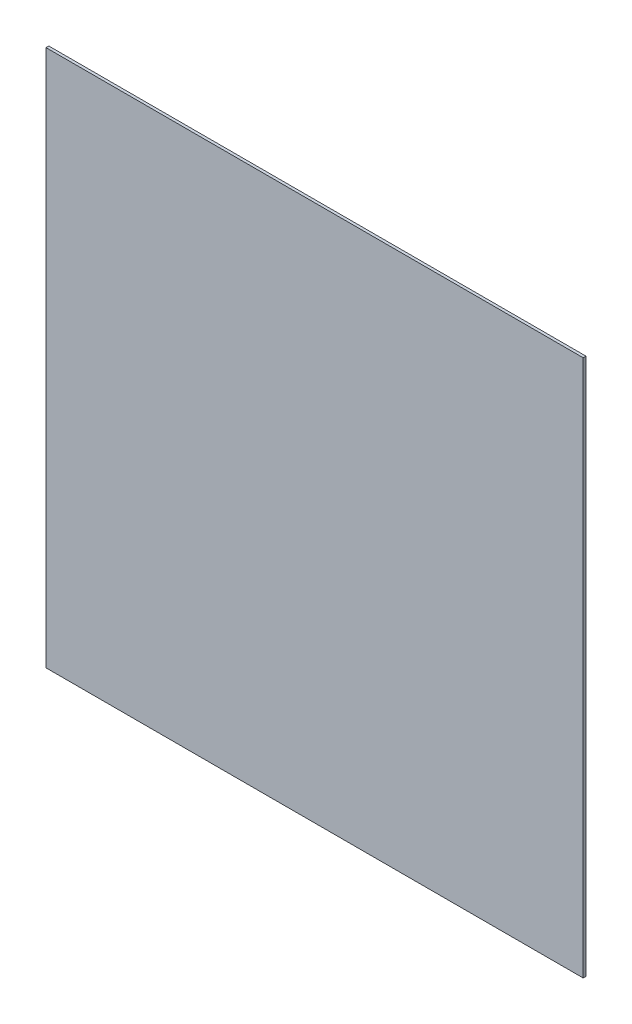
ISO-10303-21;
HEADER;
FILE_DESCRIPTION(('STEP AP214'),'2;1');
FILE_NAME('part.step','',(''),(''),'','','');
FILE_SCHEMA(('AUTOMOTIVE_DESIGN { 1 0 10303 214 1 1 1 1 }'));
ENDSEC;
DATA;
#1=APPLICATION_CONTEXT('core data for automotive mechanical design processes');
#2=APPLICATION_PROTOCOL_DEFINITION('international standard','automotive_design',2000,#1);
#3=PRODUCT_CONTEXT('',#1,'mechanical');
#4=PRODUCT('Part','Part','',(#3));
#5=PRODUCT_RELATED_PRODUCT_CATEGORY('part','',(#4));
#6=PRODUCT_DEFINITION_FORMATION('','',#4);
#7=PRODUCT_DEFINITION_CONTEXT('part definition',#1,'design');
#8=PRODUCT_DEFINITION('design','',#6,#7);
#9=PRODUCT_DEFINITION_SHAPE('','',#8);
#10=(LENGTH_UNIT() NAMED_UNIT(*) SI_UNIT(.MILLI.,.METRE.));
#11=(NAMED_UNIT(*) PLANE_ANGLE_UNIT() SI_UNIT($,.RADIAN.));
#12=(NAMED_UNIT(*) SI_UNIT($,.STERADIAN.) SOLID_ANGLE_UNIT());
#13=UNCERTAINTY_MEASURE_WITH_UNIT(LENGTH_MEASURE(1.E-05),#10,'distance_accuracy_value','');
#14=(GEOMETRIC_REPRESENTATION_CONTEXT(3) GLOBAL_UNCERTAINTY_ASSIGNED_CONTEXT((#13)) GLOBAL_UNIT_ASSIGNED_CONTEXT((#10,
#11,#12)) REPRESENTATION_CONTEXT('',''));
#15=CARTESIAN_POINT('',(0.,0.,0.));
#16=DIRECTION('',(0.,0.,1.));
#17=DIRECTION('',(1.,0.,0.));
#18=AXIS2_PLACEMENT_3D('',#15,#16,#17);
#19=CARTESIAN_POINT('',(-304.8,-304.8,1.5875));
#20=DIRECTION('',(1.,0.,0.));
#21=DIRECTION('',(0.,0.,-1.));
#22=AXIS2_PLACEMENT_3D('',#19,#20,#21);
#23=PLANE('',#22);
#24=DIRECTION('',(0.,-1.,0.));
#25=VECTOR('',#24,1.);
#26=CARTESIAN_POINT('',(-304.8,-304.8,-1.5875));
#27=LINE('',#26,#25);
#28=CARTESIAN_POINT('',(-304.8,304.8,-1.5875));
#29=VERTEX_POINT('',#28);
#30=CARTESIAN_POINT('',(-304.8,-304.8,-1.5875));
#31=VERTEX_POINT('',#30);
#32=EDGE_CURVE('E107',#29,#31,#27,.T.);
#33=ORIENTED_EDGE('',*,*,#32,.T.);
#34=DIRECTION('',(0.,0.,-1.));
#35=VECTOR('',#34,1.);
#36=CARTESIAN_POINT('',(-304.8,-304.8,1.5875));
#37=LINE('',#36,#35);
#38=CARTESIAN_POINT('',(-304.8,-304.8,1.5875));
#39=VERTEX_POINT('',#38);
#40=EDGE_CURVE('E11',#39,#31,#37,.T.);
#41=ORIENTED_EDGE('',*,*,#40,.F.);
#42=DIRECTION('',(0.,-1.,0.));
#43=VECTOR('',#42,1.);
#44=CARTESIAN_POINT('',(-304.8,-304.8,1.5875));
#45=LINE('',#44,#43);
#46=CARTESIAN_POINT('',(-304.8,304.8,1.5875));
#47=VERTEX_POINT('',#46);
#48=EDGE_CURVE('E91',#47,#39,#45,.T.);
#49=ORIENTED_EDGE('',*,*,#48,.F.);
#50=DIRECTION('',(0.,0.,-1.));
#51=VECTOR('',#50,1.);
#52=CARTESIAN_POINT('',(-304.8,304.8,1.5875));
#53=LINE('',#52,#51);
#54=EDGE_CURVE('E103',#47,#29,#53,.T.);
#55=ORIENTED_EDGE('',*,*,#54,.T.);
#56=EDGE_LOOP('',(#33,#41,#49,#55));
#57=FACE_BOUND('',#56,.T.);
#58=ADVANCED_FACE('F39',(#57),#23,.F.);
#59=CARTESIAN_POINT('',(304.8,-304.8,1.5875));
#60=DIRECTION('',(0.,1.,0.));
#61=DIRECTION('',(-1.,0.,0.));
#62=AXIS2_PLACEMENT_3D('',#59,#60,#61);
#63=PLANE('',#62);
#64=DIRECTION('',(1.,0.,0.));
#65=VECTOR('',#64,1.);
#66=CARTESIAN_POINT('',(304.8,-304.8,-1.5875));
#67=LINE('',#66,#65);
#68=CARTESIAN_POINT('',(304.8,-304.8,-1.5875));
#69=VERTEX_POINT('',#68);
#70=EDGE_CURVE('E96',#31,#69,#67,.T.);
#71=ORIENTED_EDGE('',*,*,#70,.T.);
#72=DIRECTION('',(0.,0.,-1.));
#73=VECTOR('',#72,1.);
#74=CARTESIAN_POINT('',(304.8,-304.8,1.5875));
#75=LINE('',#74,#73);
#76=CARTESIAN_POINT('',(304.8,-304.8,1.5875));
#77=VERTEX_POINT('',#76);
#78=EDGE_CURVE('E48',#77,#69,#75,.T.);
#79=ORIENTED_EDGE('',*,*,#78,.F.);
#80=DIRECTION('',(1.,0.,0.));
#81=VECTOR('',#80,1.);
#82=CARTESIAN_POINT('',(304.8,-304.8,1.5875));
#83=LINE('',#82,#81);
#84=EDGE_CURVE('E86',#39,#77,#83,.T.);
#85=ORIENTED_EDGE('',*,*,#84,.F.);
#86=ORIENTED_EDGE('',*,*,#40,.T.);
#87=EDGE_LOOP('',(#71,#79,#85,#86));
#88=FACE_BOUND('',#87,.T.);
#89=ADVANCED_FACE('F95',(#88),#63,.F.);
#90=CARTESIAN_POINT('',(304.8,-304.8,1.5875));
#91=DIRECTION('',(-1.,0.,0.));
#92=DIRECTION('',(0.,0.,1.));
#93=AXIS2_PLACEMENT_3D('',#90,#91,#92);
#94=PLANE('',#93);
#95=DIRECTION('',(0.,1.,0.));
#96=VECTOR('',#95,1.);
#97=CARTESIAN_POINT('',(304.8,-304.8,-1.5875));
#98=LINE('',#97,#96);
#99=CARTESIAN_POINT('',(304.8,304.8,-1.5875));
#100=VERTEX_POINT('',#99);
#101=EDGE_CURVE('E73',#69,#100,#98,.T.);
#102=ORIENTED_EDGE('',*,*,#101,.T.);
#103=DIRECTION('',(0.,0.,-1.));
#104=VECTOR('',#103,1.);
#105=CARTESIAN_POINT('',(304.8,304.8,1.5875));
#106=LINE('',#105,#104);
#107=CARTESIAN_POINT('',(304.8,304.8,1.5875));
#108=VERTEX_POINT('',#107);
#109=EDGE_CURVE('E98',#108,#100,#106,.T.);
#110=ORIENTED_EDGE('',*,*,#109,.F.);
#111=DIRECTION('',(0.,1.,0.));
#112=VECTOR('',#111,1.);
#113=CARTESIAN_POINT('',(304.8,-304.8,1.5875));
#114=LINE('',#113,#112);
#115=EDGE_CURVE('E89',#77,#108,#114,.T.);
#116=ORIENTED_EDGE('',*,*,#115,.F.);
#117=ORIENTED_EDGE('',*,*,#78,.T.);
#118=EDGE_LOOP('',(#102,#110,#116,#117));
#119=FACE_BOUND('',#118,.T.);
#120=ADVANCED_FACE('F99',(#119),#94,.F.);
#121=CARTESIAN_POINT('',(304.8,304.8,1.5875));
#122=DIRECTION('',(0.,-1.,0.));
#123=DIRECTION('',(1.,0.,0.));
#124=AXIS2_PLACEMENT_3D('',#121,#122,#123);
#125=PLANE('',#124);
#126=DIRECTION('',(-1.,0.,0.));
#127=VECTOR('',#126,1.);
#128=CARTESIAN_POINT('',(304.8,304.8,-1.5875));
#129=LINE('',#128,#127);
#130=EDGE_CURVE('E79',#100,#29,#129,.T.);
#131=ORIENTED_EDGE('',*,*,#130,.T.);
#132=ORIENTED_EDGE('',*,*,#54,.F.);
#133=DIRECTION('',(-1.,0.,0.));
#134=VECTOR('',#133,1.);
#135=CARTESIAN_POINT('',(304.8,304.8,1.5875));
#136=LINE('',#135,#134);
#137=EDGE_CURVE('E56',#108,#47,#136,.T.);
#138=ORIENTED_EDGE('',*,*,#137,.F.);
#139=ORIENTED_EDGE('',*,*,#109,.T.);
#140=EDGE_LOOP('',(#131,#132,#138,#139));
#141=FACE_BOUND('',#140,.T.);
#142=ADVANCED_FACE('F120',(#141),#125,.F.);
#143=CARTESIAN_POINT('',(0.,0.,1.5875));
#144=DIRECTION('',(0.,0.,1.));
#145=DIRECTION('',(1.,0.,0.));
#146=AXIS2_PLACEMENT_3D('',#143,#144,#145);
#147=PLANE('',#146);
#148=ORIENTED_EDGE('',*,*,#48,.T.);
#149=ORIENTED_EDGE('',*,*,#84,.T.);
#150=ORIENTED_EDGE('',*,*,#115,.T.);
#151=ORIENTED_EDGE('',*,*,#137,.T.);
#152=EDGE_LOOP('',(#148,#149,#150,#151));
#153=FACE_BOUND('',#152,.T.);
#154=ADVANCED_FACE('F87',(#153),#147,.T.);
#155=CARTESIAN_POINT('',(0.,0.,-1.5875));
#156=DIRECTION('',(0.,0.,1.));
#157=DIRECTION('',(1.,0.,0.));
#158=AXIS2_PLACEMENT_3D('',#155,#156,#157);
#159=PLANE('',#158);
#160=ORIENTED_EDGE('',*,*,#32,.F.);
#161=ORIENTED_EDGE('',*,*,#130,.F.);
#162=ORIENTED_EDGE('',*,*,#101,.F.);
#163=ORIENTED_EDGE('',*,*,#70,.F.);
#164=EDGE_LOOP('',(#160,#161,#162,#163));
#165=FACE_BOUND('',#164,.T.);
#166=ADVANCED_FACE('F123',(#165),#159,.F.);
#167=CLOSED_SHELL('',(#58,#89,#120,#142,#154,#166));
#168=MANIFOLD_SOLID_BREP('B2',#167);
#169=ADVANCED_BREP_SHAPE_REPRESENTATION('',(#18,#168),#14);
#170=SHAPE_DEFINITION_REPRESENTATION(#9,#169);
ENDSEC;
END-ISO-10303-21;
